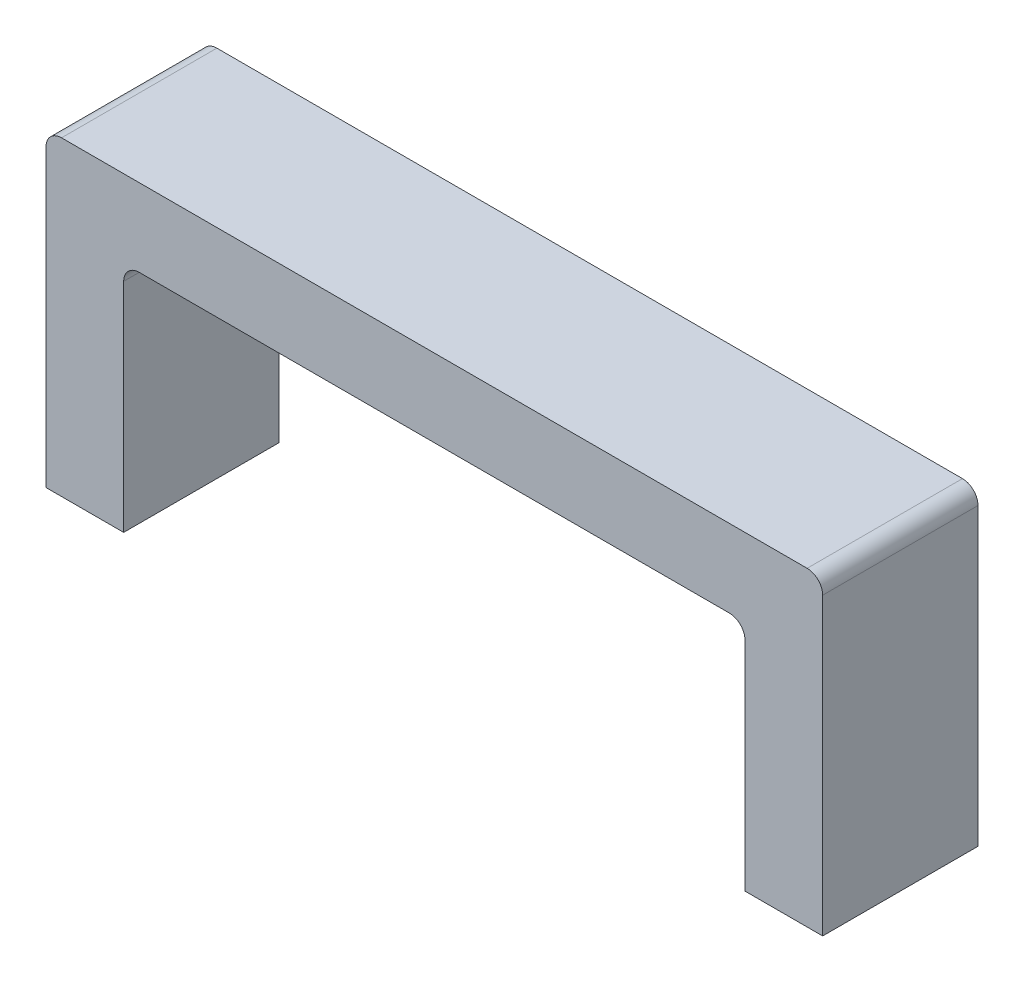
ISO-10303-21;
HEADER;
FILE_DESCRIPTION(('STEP AP214'),'2;1');
FILE_NAME('part.step','',(''),(''),'','','');
FILE_SCHEMA(('AUTOMOTIVE_DESIGN { 1 0 10303 214 1 1 1 1 }'));
ENDSEC;
DATA;
#1=APPLICATION_CONTEXT('core data for automotive mechanical design processes');
#2=APPLICATION_PROTOCOL_DEFINITION('international standard','automotive_design',2000,#1);
#3=PRODUCT_CONTEXT('',#1,'mechanical');
#4=PRODUCT('Part','Part','',(#3));
#5=PRODUCT_RELATED_PRODUCT_CATEGORY('part','',(#4));
#6=PRODUCT_DEFINITION_FORMATION('','',#4);
#7=PRODUCT_DEFINITION_CONTEXT('part definition',#1,'design');
#8=PRODUCT_DEFINITION('design','',#6,#7);
#9=PRODUCT_DEFINITION_SHAPE('','',#8);
#10=(LENGTH_UNIT() NAMED_UNIT(*) SI_UNIT(.MILLI.,.METRE.));
#11=(NAMED_UNIT(*) PLANE_ANGLE_UNIT() SI_UNIT($,.RADIAN.));
#12=(NAMED_UNIT(*) SI_UNIT($,.STERADIAN.) SOLID_ANGLE_UNIT());
#13=UNCERTAINTY_MEASURE_WITH_UNIT(LENGTH_MEASURE(1.E-05),#10,'distance_accuracy_value','');
#14=(GEOMETRIC_REPRESENTATION_CONTEXT(3) GLOBAL_UNCERTAINTY_ASSIGNED_CONTEXT((#13)) GLOBAL_UNIT_ASSIGNED_CONTEXT((#10,
#11,#12)) REPRESENTATION_CONTEXT('',''));
#15=CARTESIAN_POINT('',(0.,0.,0.));
#16=DIRECTION('',(0.,0.,1.));
#17=DIRECTION('',(1.,0.,0.));
#18=AXIS2_PLACEMENT_3D('',#15,#16,#17);
#19=CARTESIAN_POINT('',(0.,0.,25.4));
#20=DIRECTION('',(0.,1.,0.));
#21=DIRECTION('',(0.,0.,1.));
#22=AXIS2_PLACEMENT_3D('',#19,#20,#21);
#23=PLANE('',#22);
#24=DIRECTION('',(1.,0.,0.));
#25=VECTOR('',#24,1.);
#26=CARTESIAN_POINT('',(0.,0.,0.));
#27=LINE('',#26,#25);
#28=CARTESIAN_POINT('',(0.,0.,0.));
#29=VERTEX_POINT('',#28);
#30=CARTESIAN_POINT('',(12.7,0.,0.));
#31=VERTEX_POINT('',#30);
#32=EDGE_CURVE('E157',#29,#31,#27,.T.);
#33=ORIENTED_EDGE('',*,*,#32,.T.);
#34=DIRECTION('',(0.,0.,-1.));
#35=VECTOR('',#34,1.);
#36=CARTESIAN_POINT('',(12.7,0.,25.4));
#37=LINE('',#36,#35);
#38=CARTESIAN_POINT('',(12.7,0.,25.4));
#39=VERTEX_POINT('',#38);
#40=EDGE_CURVE('E11',#39,#31,#37,.T.);
#41=ORIENTED_EDGE('',*,*,#40,.F.);
#42=DIRECTION('',(1.,0.,0.));
#43=VECTOR('',#42,1.);
#44=CARTESIAN_POINT('',(0.,0.,25.4));
#45=LINE('',#44,#43);
#46=CARTESIAN_POINT('',(0.,0.,25.4));
#47=VERTEX_POINT('',#46);
#48=EDGE_CURVE('E179',#47,#39,#45,.T.);
#49=ORIENTED_EDGE('',*,*,#48,.F.);
#50=DIRECTION('',(0.,0.,-1.));
#51=VECTOR('',#50,1.);
#52=CARTESIAN_POINT('',(0.,0.,25.4));
#53=LINE('',#52,#51);
#54=EDGE_CURVE('E153',#47,#29,#53,.T.);
#55=ORIENTED_EDGE('',*,*,#54,.T.);
#56=EDGE_LOOP('',(#33,#41,#49,#55));
#57=FACE_BOUND('',#56,.T.);
#58=ADVANCED_FACE('F37',(#57),#23,.F.);
#59=CARTESIAN_POINT('',(12.7,0.,25.4));
#60=DIRECTION('',(-1.,0.,0.));
#61=DIRECTION('',(0.,-1.,0.));
#62=AXIS2_PLACEMENT_3D('',#59,#60,#61);
#63=PLANE('',#62);
#64=DIRECTION('',(0.,1.,0.));
#65=VECTOR('',#64,1.);
#66=CARTESIAN_POINT('',(12.7,0.,0.));
#67=LINE('',#66,#65);
#68=CARTESIAN_POINT('',(12.7,35.56,0.));
#69=VERTEX_POINT('',#68);
#70=EDGE_CURVE('E160',#31,#69,#67,.T.);
#71=ORIENTED_EDGE('',*,*,#70,.T.);
#72=DIRECTION('',(0.,0.,-1.));
#73=VECTOR('',#72,1.);
#74=CARTESIAN_POINT('',(12.7,35.56,25.4));
#75=LINE('',#74,#73);
#76=CARTESIAN_POINT('',(12.7,35.56,25.4));
#77=VERTEX_POINT('',#76);
#78=EDGE_CURVE('E45',#77,#69,#75,.T.);
#79=ORIENTED_EDGE('',*,*,#78,.F.);
#80=DIRECTION('',(0.,1.,0.));
#81=VECTOR('',#80,1.);
#82=CARTESIAN_POINT('',(12.7,0.,25.4));
#83=LINE('',#82,#81);
#84=EDGE_CURVE('E108',#39,#77,#83,.T.);
#85=ORIENTED_EDGE('',*,*,#84,.F.);
#86=ORIENTED_EDGE('',*,*,#40,.T.);
#87=EDGE_LOOP('',(#71,#79,#85,#86));
#88=FACE_BOUND('',#87,.T.);
#89=ADVANCED_FACE('F257',(#88),#63,.F.);
#90=CARTESIAN_POINT('',(15.24,35.56,25.4));
#91=DIRECTION('',(0.,0.,-1.));
#92=DIRECTION('',(-1.,0.,0.));
#93=AXIS2_PLACEMENT_3D('',#90,#91,#92);
#94=CYLINDRICAL_SURFACE('',#93,2.54);
#95=CARTESIAN_POINT('',(15.24,35.56,0.));
#96=DIRECTION('',(0.,0.,-1.));
#97=DIRECTION('',(1.,0.,0.));
#98=AXIS2_PLACEMENT_3D('',#95,#96,#97);
#99=CIRCLE('',#98,2.54);
#100=CARTESIAN_POINT('',(15.24,38.1,0.));
#101=VERTEX_POINT('',#100);
#102=EDGE_CURVE('E162',#69,#101,#99,.T.);
#103=ORIENTED_EDGE('',*,*,#102,.T.);
#104=DIRECTION('',(0.,0.,-1.));
#105=VECTOR('',#104,1.);
#106=CARTESIAN_POINT('',(15.24,38.1,25.4));
#107=LINE('',#106,#105);
#108=CARTESIAN_POINT('',(15.24,38.1,25.4));
#109=VERTEX_POINT('',#108);
#110=EDGE_CURVE('E198',#109,#101,#107,.T.);
#111=ORIENTED_EDGE('',*,*,#110,.F.);
#112=CARTESIAN_POINT('',(15.24,35.56,25.4));
#113=DIRECTION('',(0.,0.,-1.));
#114=DIRECTION('',(1.,0.,0.));
#115=AXIS2_PLACEMENT_3D('',#112,#113,#114);
#116=CIRCLE('',#115,2.54);
#117=EDGE_CURVE('E206',#77,#109,#116,.T.);
#118=ORIENTED_EDGE('',*,*,#117,.F.);
#119=ORIENTED_EDGE('',*,*,#78,.T.);
#120=EDGE_LOOP('',(#103,#111,#118,#119));
#121=FACE_BOUND('',#120,.T.);
#122=ADVANCED_FACE('F204',(#121),#94,.F.);
#123=CARTESIAN_POINT('',(15.24,38.1,25.4));
#124=DIRECTION('',(0.,1.,0.));
#125=DIRECTION('',(0.,0.,1.));
#126=AXIS2_PLACEMENT_3D('',#123,#124,#125);
#127=PLANE('',#126);
#128=DIRECTION('',(1.,0.,0.));
#129=VECTOR('',#128,1.);
#130=CARTESIAN_POINT('',(15.24,38.1,0.));
#131=LINE('',#130,#129);
#132=CARTESIAN_POINT('',(111.76,38.1,0.));
#133=VERTEX_POINT('',#132);
#134=EDGE_CURVE('E164',#101,#133,#131,.T.);
#135=ORIENTED_EDGE('',*,*,#134,.T.);
#136=DIRECTION('',(0.,0.,-1.));
#137=VECTOR('',#136,1.);
#138=CARTESIAN_POINT('',(111.76,38.1,25.4));
#139=LINE('',#138,#137);
#140=CARTESIAN_POINT('',(111.76,38.1,25.4));
#141=VERTEX_POINT('',#140);
#142=EDGE_CURVE('E195',#141,#133,#139,.T.);
#143=ORIENTED_EDGE('',*,*,#142,.F.);
#144=DIRECTION('',(1.,0.,0.));
#145=VECTOR('',#144,1.);
#146=CARTESIAN_POINT('',(15.24,38.1,25.4));
#147=LINE('',#146,#145);
#148=EDGE_CURVE('E224',#109,#141,#147,.T.);
#149=ORIENTED_EDGE('',*,*,#148,.F.);
#150=ORIENTED_EDGE('',*,*,#110,.T.);
#151=EDGE_LOOP('',(#135,#143,#149,#150));
#152=FACE_BOUND('',#151,.T.);
#153=ADVANCED_FACE('F215',(#152),#127,.F.);
#154=CARTESIAN_POINT('',(111.76,35.56,25.4));
#155=DIRECTION('',(0.,0.,-1.));
#156=DIRECTION('',(-1.,0.,0.));
#157=AXIS2_PLACEMENT_3D('',#154,#155,#156);
#158=CYLINDRICAL_SURFACE('',#157,2.53999999999999);
#159=CARTESIAN_POINT('',(111.76,35.56,0.));
#160=DIRECTION('',(0.,0.,-1.));
#161=DIRECTION('',(1.,0.,0.));
#162=AXIS2_PLACEMENT_3D('',#159,#160,#161);
#163=CIRCLE('',#162,2.53999999999999);
#164=CARTESIAN_POINT('',(114.3,35.56,0.));
#165=VERTEX_POINT('',#164);
#166=EDGE_CURVE('E166',#133,#165,#163,.T.);
#167=ORIENTED_EDGE('',*,*,#166,.T.);
#168=DIRECTION('',(0.,0.,-1.));
#169=VECTOR('',#168,1.);
#170=CARTESIAN_POINT('',(114.3,35.56,25.4));
#171=LINE('',#170,#169);
#172=CARTESIAN_POINT('',(114.3,35.56,25.4));
#173=VERTEX_POINT('',#172);
#174=EDGE_CURVE('E192',#173,#165,#171,.T.);
#175=ORIENTED_EDGE('',*,*,#174,.F.);
#176=CARTESIAN_POINT('',(111.76,35.56,25.4));
#177=DIRECTION('',(0.,0.,-1.));
#178=DIRECTION('',(1.,0.,0.));
#179=AXIS2_PLACEMENT_3D('',#176,#177,#178);
#180=CIRCLE('',#179,2.53999999999999);
#181=EDGE_CURVE('E221',#141,#173,#180,.T.);
#182=ORIENTED_EDGE('',*,*,#181,.F.);
#183=ORIENTED_EDGE('',*,*,#142,.T.);
#184=EDGE_LOOP('',(#167,#175,#182,#183));
#185=FACE_BOUND('',#184,.T.);
#186=ADVANCED_FACE('F219',(#185),#158,.F.);
#187=CARTESIAN_POINT('',(114.3,35.56,25.4));
#188=DIRECTION('',(1.,0.,0.));
#189=DIRECTION('',(0.,1.,0.));
#190=AXIS2_PLACEMENT_3D('',#187,#188,#189);
#191=PLANE('',#190);
#192=DIRECTION('',(0.,-1.,0.));
#193=VECTOR('',#192,1.);
#194=CARTESIAN_POINT('',(114.3,35.56,0.));
#195=LINE('',#194,#193);
#196=CARTESIAN_POINT('',(114.3,0.,0.));
#197=VERTEX_POINT('',#196);
#198=EDGE_CURVE('E168',#165,#197,#195,.T.);
#199=ORIENTED_EDGE('',*,*,#198,.T.);
#200=DIRECTION('',(0.,0.,-1.));
#201=VECTOR('',#200,1.);
#202=CARTESIAN_POINT('',(114.3,0.,25.4));
#203=LINE('',#202,#201);
#204=CARTESIAN_POINT('',(114.3,0.,25.4));
#205=VERTEX_POINT('',#204);
#206=EDGE_CURVE('E189',#205,#197,#203,.T.);
#207=ORIENTED_EDGE('',*,*,#206,.F.);
#208=DIRECTION('',(0.,-1.,0.));
#209=VECTOR('',#208,1.);
#210=CARTESIAN_POINT('',(114.3,35.56,25.4));
#211=LINE('',#210,#209);
#212=EDGE_CURVE('E223',#173,#205,#211,.T.);
#213=ORIENTED_EDGE('',*,*,#212,.F.);
#214=ORIENTED_EDGE('',*,*,#174,.T.);
#215=EDGE_LOOP('',(#199,#207,#213,#214));
#216=FACE_BOUND('',#215,.T.);
#217=ADVANCED_FACE('F270',(#216),#191,.F.);
#218=CARTESIAN_POINT('',(114.3,0.,25.4));
#219=DIRECTION('',(0.,1.,0.));
#220=DIRECTION('',(0.,0.,1.));
#221=AXIS2_PLACEMENT_3D('',#218,#219,#220);
#222=PLANE('',#221);
#223=DIRECTION('',(1.,0.,0.));
#224=VECTOR('',#223,1.);
#225=CARTESIAN_POINT('',(114.3,0.,0.));
#226=LINE('',#225,#224);
#227=CARTESIAN_POINT('',(127.,0.,0.));
#228=VERTEX_POINT('',#227);
#229=EDGE_CURVE('E170',#197,#228,#226,.T.);
#230=ORIENTED_EDGE('',*,*,#229,.T.);
#231=DIRECTION('',(0.,0.,-1.));
#232=VECTOR('',#231,1.);
#233=CARTESIAN_POINT('',(127.,0.,25.4));
#234=LINE('',#233,#232);
#235=CARTESIAN_POINT('',(127.,0.,25.4));
#236=VERTEX_POINT('',#235);
#237=EDGE_CURVE('E186',#236,#228,#234,.T.);
#238=ORIENTED_EDGE('',*,*,#237,.F.);
#239=DIRECTION('',(1.,0.,0.));
#240=VECTOR('',#239,1.);
#241=CARTESIAN_POINT('',(114.3,0.,25.4));
#242=LINE('',#241,#240);
#243=EDGE_CURVE('E226',#205,#236,#242,.T.);
#244=ORIENTED_EDGE('',*,*,#243,.F.);
#245=ORIENTED_EDGE('',*,*,#206,.T.);
#246=EDGE_LOOP('',(#230,#238,#244,#245));
#247=FACE_BOUND('',#246,.T.);
#248=ADVANCED_FACE('F273',(#247),#222,.F.);
#249=CARTESIAN_POINT('',(127.,48.26,25.4));
#250=DIRECTION('',(-1.,0.,0.));
#251=DIRECTION('',(0.,0.,1.));
#252=AXIS2_PLACEMENT_3D('',#249,#250,#251);
#253=PLANE('',#252);
#254=DIRECTION('',(0.,1.,0.));
#255=VECTOR('',#254,1.);
#256=CARTESIAN_POINT('',(127.,48.26,0.));
#257=LINE('',#256,#255);
#258=CARTESIAN_POINT('',(127.,48.26,0.));
#259=VERTEX_POINT('',#258);
#260=EDGE_CURVE('E172',#228,#259,#257,.T.);
#261=ORIENTED_EDGE('',*,*,#260,.T.);
#262=DIRECTION('',(0.,0.,-1.));
#263=VECTOR('',#262,1.);
#264=CARTESIAN_POINT('',(127.,48.26,25.4));
#265=LINE('',#264,#263);
#266=CARTESIAN_POINT('',(127.,48.26,25.4));
#267=VERTEX_POINT('',#266);
#268=EDGE_CURVE('E183',#267,#259,#265,.T.);
#269=ORIENTED_EDGE('',*,*,#268,.F.);
#270=DIRECTION('',(0.,1.,0.));
#271=VECTOR('',#270,1.);
#272=CARTESIAN_POINT('',(127.,48.26,25.4));
#273=LINE('',#272,#271);
#274=EDGE_CURVE('E232',#236,#267,#273,.T.);
#275=ORIENTED_EDGE('',*,*,#274,.F.);
#276=ORIENTED_EDGE('',*,*,#237,.T.);
#277=EDGE_LOOP('',(#261,#269,#275,#276));
#278=FACE_BOUND('',#277,.T.);
#279=ADVANCED_FACE('F238',(#278),#253,.F.);
#280=CARTESIAN_POINT('',(124.46,48.26,25.4));
#281=DIRECTION('',(0.,0.,-1.));
#282=DIRECTION('',(-1.,0.,0.));
#283=AXIS2_PLACEMENT_3D('',#280,#281,#282);
#284=CYLINDRICAL_SURFACE('',#283,2.54);
#285=CARTESIAN_POINT('',(124.46,48.26,0.));
#286=DIRECTION('',(0.,0.,1.));
#287=DIRECTION('',(-1.,0.,0.));
#288=AXIS2_PLACEMENT_3D('',#285,#286,#287);
#289=CIRCLE('',#288,2.54);
#290=CARTESIAN_POINT('',(124.46,50.8,0.));
#291=VERTEX_POINT('',#290);
#292=EDGE_CURVE('E174',#259,#291,#289,.T.);
#293=ORIENTED_EDGE('',*,*,#292,.T.);
#294=DIRECTION('',(0.,0.,-1.));
#295=VECTOR('',#294,1.);
#296=CARTESIAN_POINT('',(124.46,50.8,25.4));
#297=LINE('',#296,#295);
#298=CARTESIAN_POINT('',(124.46,50.8,25.4));
#299=VERTEX_POINT('',#298);
#300=EDGE_CURVE('E148',#299,#291,#297,.T.);
#301=ORIENTED_EDGE('',*,*,#300,.F.);
#302=CARTESIAN_POINT('',(124.46,48.26,25.4));
#303=DIRECTION('',(0.,0.,1.));
#304=DIRECTION('',(-1.,0.,0.));
#305=AXIS2_PLACEMENT_3D('',#302,#303,#304);
#306=CIRCLE('',#305,2.54);
#307=EDGE_CURVE('E139',#267,#299,#306,.T.);
#308=ORIENTED_EDGE('',*,*,#307,.F.);
#309=ORIENTED_EDGE('',*,*,#268,.T.);
#310=EDGE_LOOP('',(#293,#301,#308,#309));
#311=FACE_BOUND('',#310,.T.);
#312=ADVANCED_FACE('F242',(#311),#284,.T.);
#313=CARTESIAN_POINT('',(2.54000000000002,50.8,25.4));
#314=DIRECTION('',(0.,-1.,0.));
#315=DIRECTION('',(0.,0.,-1.));
#316=AXIS2_PLACEMENT_3D('',#313,#314,#315);
#317=PLANE('',#316);
#318=DIRECTION('',(-1.,0.,0.));
#319=VECTOR('',#318,1.);
#320=CARTESIAN_POINT('',(2.54000000000002,50.8,0.));
#321=LINE('',#320,#319);
#322=CARTESIAN_POINT('',(2.54000000000002,50.8,0.));
#323=VERTEX_POINT('',#322);
#324=EDGE_CURVE('E147',#291,#323,#321,.T.);
#325=ORIENTED_EDGE('',*,*,#324,.T.);
#326=DIRECTION('',(0.,0.,-1.));
#327=VECTOR('',#326,1.);
#328=CARTESIAN_POINT('',(2.54000000000002,50.8,25.4));
#329=LINE('',#328,#327);
#330=CARTESIAN_POINT('',(2.54000000000002,50.8,25.4));
#331=VERTEX_POINT('',#330);
#332=EDGE_CURVE('E144',#331,#323,#329,.T.);
#333=ORIENTED_EDGE('',*,*,#332,.F.);
#334=DIRECTION('',(-1.,0.,0.));
#335=VECTOR('',#334,1.);
#336=CARTESIAN_POINT('',(2.54000000000002,50.8,25.4));
#337=LINE('',#336,#335);
#338=EDGE_CURVE('E133',#299,#331,#337,.T.);
#339=ORIENTED_EDGE('',*,*,#338,.F.);
#340=ORIENTED_EDGE('',*,*,#300,.T.);
#341=EDGE_LOOP('',(#325,#333,#339,#340));
#342=FACE_BOUND('',#341,.T.);
#343=ADVANCED_FACE('F145',(#342),#317,.F.);
#344=CARTESIAN_POINT('',(2.54,48.26,25.4));
#345=DIRECTION('',(0.,0.,-1.));
#346=DIRECTION('',(-1.,0.,0.));
#347=AXIS2_PLACEMENT_3D('',#344,#345,#346);
#348=CYLINDRICAL_SURFACE('',#347,2.54);
#349=CARTESIAN_POINT('',(2.54,48.26,0.));
#350=DIRECTION('',(0.,0.,1.));
#351=DIRECTION('',(1.,0.,0.));
#352=AXIS2_PLACEMENT_3D('',#349,#350,#351);
#353=CIRCLE('',#352,2.54);
#354=CARTESIAN_POINT('',(0.,48.26,0.));
#355=VERTEX_POINT('',#354);
#356=EDGE_CURVE('E94',#323,#355,#353,.T.);
#357=ORIENTED_EDGE('',*,*,#356,.T.);
#358=DIRECTION('',(0.,0.,-1.));
#359=VECTOR('',#358,1.);
#360=CARTESIAN_POINT('',(0.,48.26,25.4));
#361=LINE('',#360,#359);
#362=CARTESIAN_POINT('',(0.,48.26,25.4));
#363=VERTEX_POINT('',#362);
#364=EDGE_CURVE('E149',#363,#355,#361,.T.);
#365=ORIENTED_EDGE('',*,*,#364,.F.);
#366=CARTESIAN_POINT('',(2.54,48.26,25.4));
#367=DIRECTION('',(0.,0.,1.));
#368=DIRECTION('',(1.,0.,0.));
#369=AXIS2_PLACEMENT_3D('',#366,#367,#368);
#370=CIRCLE('',#369,2.54);
#371=EDGE_CURVE('E137',#331,#363,#370,.T.);
#372=ORIENTED_EDGE('',*,*,#371,.F.);
#373=ORIENTED_EDGE('',*,*,#332,.T.);
#374=EDGE_LOOP('',(#357,#365,#372,#373));
#375=FACE_BOUND('',#374,.T.);
#376=ADVANCED_FACE('F151',(#375),#348,.T.);
#377=CARTESIAN_POINT('',(0.,0.,25.4));
#378=DIRECTION('',(1.,0.,0.));
#379=DIRECTION('',(0.,0.,-1.));
#380=AXIS2_PLACEMENT_3D('',#377,#378,#379);
#381=PLANE('',#380);
#382=DIRECTION('',(0.,-1.,0.));
#383=VECTOR('',#382,1.);
#384=CARTESIAN_POINT('',(0.,0.,0.));
#385=LINE('',#384,#383);
#386=EDGE_CURVE('E100',#355,#29,#385,.T.);
#387=ORIENTED_EDGE('',*,*,#386,.T.);
#388=ORIENTED_EDGE('',*,*,#54,.F.);
#389=DIRECTION('',(0.,-1.,0.));
#390=VECTOR('',#389,1.);
#391=CARTESIAN_POINT('',(0.,0.,25.4));
#392=LINE('',#391,#390);
#393=EDGE_CURVE('E53',#363,#47,#392,.T.);
#394=ORIENTED_EDGE('',*,*,#393,.F.);
#395=ORIENTED_EDGE('',*,*,#364,.T.);
#396=EDGE_LOOP('',(#387,#388,#394,#395));
#397=FACE_BOUND('',#396,.T.);
#398=ADVANCED_FACE('F246',(#397),#381,.F.);
#399=CARTESIAN_POINT('',(15.24,35.56,25.4));
#400=DIRECTION('',(0.,0.,1.));
#401=DIRECTION('',(1.,0.,0.));
#402=AXIS2_PLACEMENT_3D('',#399,#400,#401);
#403=PLANE('',#402);
#404=ORIENTED_EDGE('',*,*,#48,.T.);
#405=ORIENTED_EDGE('',*,*,#84,.T.);
#406=ORIENTED_EDGE('',*,*,#117,.T.);
#407=ORIENTED_EDGE('',*,*,#148,.T.);
#408=ORIENTED_EDGE('',*,*,#181,.T.);
#409=ORIENTED_EDGE('',*,*,#212,.T.);
#410=ORIENTED_EDGE('',*,*,#243,.T.);
#411=ORIENTED_EDGE('',*,*,#274,.T.);
#412=ORIENTED_EDGE('',*,*,#307,.T.);
#413=ORIENTED_EDGE('',*,*,#338,.T.);
#414=ORIENTED_EDGE('',*,*,#371,.T.);
#415=ORIENTED_EDGE('',*,*,#393,.T.);
#416=EDGE_LOOP('',(#404,#405,#406,#407,#408,#409,#410,#411,#412,#413,#414,#415));
#417=FACE_BOUND('',#416,.T.);
#418=ADVANCED_FACE('F135',(#417),#403,.T.);
#419=CARTESIAN_POINT('',(15.24,35.56,0.));
#420=DIRECTION('',(0.,0.,1.));
#421=DIRECTION('',(1.,0.,0.));
#422=AXIS2_PLACEMENT_3D('',#419,#420,#421);
#423=PLANE('',#422);
#424=ORIENTED_EDGE('',*,*,#32,.F.);
#425=ORIENTED_EDGE('',*,*,#386,.F.);
#426=ORIENTED_EDGE('',*,*,#356,.F.);
#427=ORIENTED_EDGE('',*,*,#324,.F.);
#428=ORIENTED_EDGE('',*,*,#292,.F.);
#429=ORIENTED_EDGE('',*,*,#260,.F.);
#430=ORIENTED_EDGE('',*,*,#229,.F.);
#431=ORIENTED_EDGE('',*,*,#198,.F.);
#432=ORIENTED_EDGE('',*,*,#166,.F.);
#433=ORIENTED_EDGE('',*,*,#134,.F.);
#434=ORIENTED_EDGE('',*,*,#102,.F.);
#435=ORIENTED_EDGE('',*,*,#70,.F.);
#436=EDGE_LOOP('',(#424,#425,#426,#427,#428,#429,#430,#431,#432,#433,#434,#435));
#437=FACE_BOUND('',#436,.T.);
#438=ADVANCED_FACE('F210',(#437),#423,.F.);
#439=CLOSED_SHELL('',(#58,#89,#122,#153,#186,#217,#248,#279,#312,#343,#376,#398,#418,#438));
#440=MANIFOLD_SOLID_BREP('B2',#439);
#441=ADVANCED_BREP_SHAPE_REPRESENTATION('',(#18,#440),#14);
#442=SHAPE_DEFINITION_REPRESENTATION(#9,#441);
ENDSEC;
END-ISO-10303-21;
